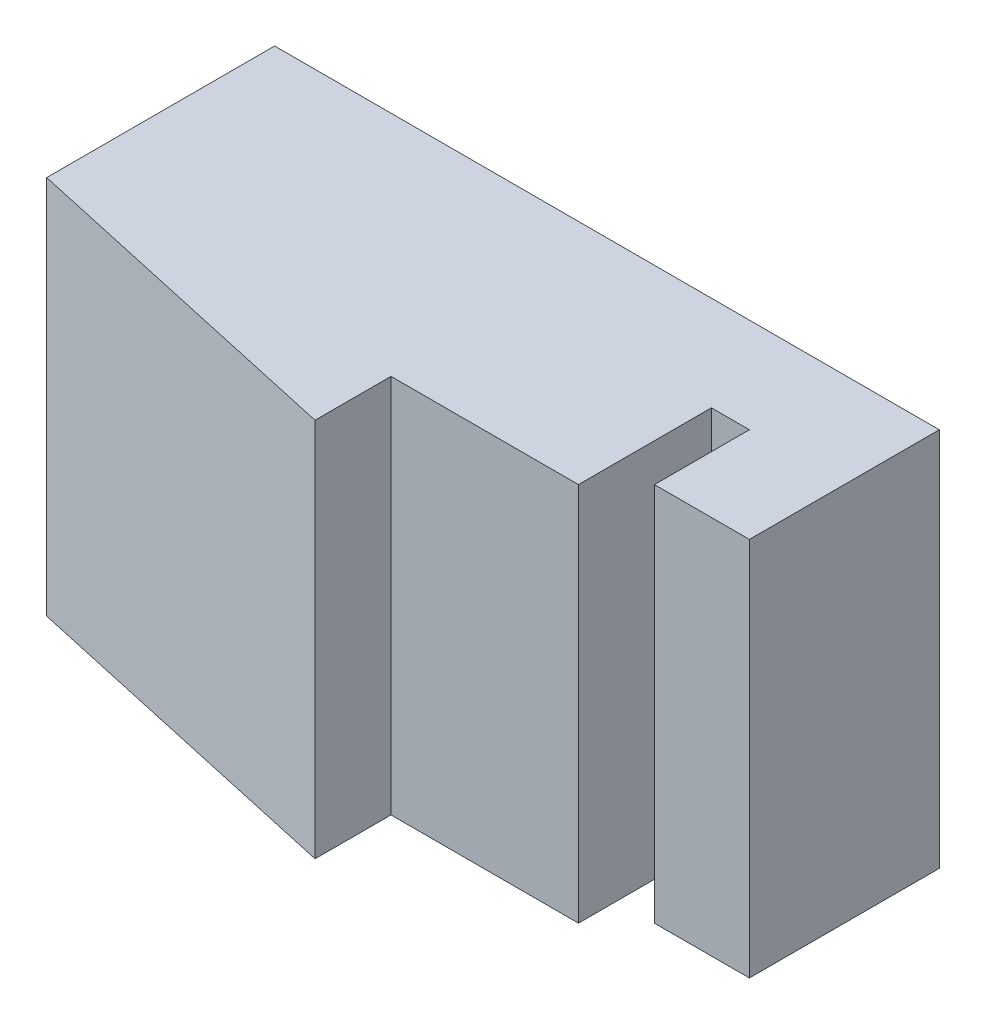
ISO-10303-21;
HEADER;
FILE_DESCRIPTION(('STEP AP214'),'2;1');
FILE_NAME('part.step','',(''),(''),'','','');
FILE_SCHEMA(('AUTOMOTIVE_DESIGN { 1 0 10303 214 1 1 1 1 }'));
ENDSEC;
DATA;
#1=APPLICATION_CONTEXT('core data for automotive mechanical design processes');
#2=APPLICATION_PROTOCOL_DEFINITION('international standard','automotive_design',2000,#1);
#3=PRODUCT_CONTEXT('',#1,'mechanical');
#4=PRODUCT('Part','Part','',(#3));
#5=PRODUCT_RELATED_PRODUCT_CATEGORY('part','',(#4));
#6=PRODUCT_DEFINITION_FORMATION('','',#4);
#7=PRODUCT_DEFINITION_CONTEXT('part definition',#1,'design');
#8=PRODUCT_DEFINITION('design','',#6,#7);
#9=PRODUCT_DEFINITION_SHAPE('','',#8);
#10=(LENGTH_UNIT() NAMED_UNIT(*) SI_UNIT(.MILLI.,.METRE.));
#11=(NAMED_UNIT(*) PLANE_ANGLE_UNIT() SI_UNIT($,.RADIAN.));
#12=(NAMED_UNIT(*) SI_UNIT($,.STERADIAN.) SOLID_ANGLE_UNIT());
#13=UNCERTAINTY_MEASURE_WITH_UNIT(LENGTH_MEASURE(1.E-05),#10,'distance_accuracy_value','');
#14=(GEOMETRIC_REPRESENTATION_CONTEXT(3) GLOBAL_UNCERTAINTY_ASSIGNED_CONTEXT((#13)) GLOBAL_UNIT_ASSIGNED_CONTEXT((#10,
#11,#12)) REPRESENTATION_CONTEXT('',''));
#15=CARTESIAN_POINT('',(0.,0.,0.));
#16=DIRECTION('',(0.,0.,1.));
#17=DIRECTION('',(1.,0.,0.));
#18=AXIS2_PLACEMENT_3D('',#15,#16,#17);
#19=CARTESIAN_POINT('',(-27.6289979058364,20.,0.));
#20=DIRECTION('',(1.,0.,0.));
#21=DIRECTION('',(0.,0.,-1.));
#22=AXIS2_PLACEMENT_3D('',#19,#20,#21);
#23=PLANE('',#22);
#24=DIRECTION('',(0.,0.,1.));
#25=VECTOR('',#24,1.);
#26=CARTESIAN_POINT('',(-27.6289979058364,0.,0.));
#27=LINE('',#26,#25);
#28=CARTESIAN_POINT('',(-27.6289979058364,0.,0.));
#29=VERTEX_POINT('',#28);
#30=CARTESIAN_POINT('',(-27.6289979058364,0.,12.));
#31=VERTEX_POINT('',#30);
#32=EDGE_CURVE('E141',#29,#31,#27,.T.);
#33=ORIENTED_EDGE('',*,*,#32,.T.);
#34=DIRECTION('',(0.,-1.,0.));
#35=VECTOR('',#34,1.);
#36=CARTESIAN_POINT('',(-27.6289979058364,20.,12.));
#37=LINE('',#36,#35);
#38=CARTESIAN_POINT('',(-27.6289979058364,20.,12.));
#39=VERTEX_POINT('',#38);
#40=EDGE_CURVE('E11',#39,#31,#37,.T.);
#41=ORIENTED_EDGE('',*,*,#40,.F.);
#42=DIRECTION('',(0.,0.,1.));
#43=VECTOR('',#42,1.);
#44=CARTESIAN_POINT('',(-27.6289979058364,20.,0.));
#45=LINE('',#44,#43);
#46=CARTESIAN_POINT('',(-27.6289979058364,20.,0.));
#47=VERTEX_POINT('',#46);
#48=EDGE_CURVE('E159',#47,#39,#45,.T.);
#49=ORIENTED_EDGE('',*,*,#48,.F.);
#50=DIRECTION('',(0.,-1.,0.));
#51=VECTOR('',#50,1.);
#52=CARTESIAN_POINT('',(-27.6289979058364,20.,0.));
#53=LINE('',#52,#51);
#54=EDGE_CURVE('E137',#47,#29,#53,.T.);
#55=ORIENTED_EDGE('',*,*,#54,.T.);
#56=EDGE_LOOP('',(#33,#41,#49,#55));
#57=FACE_BOUND('',#56,.T.);
#58=ADVANCED_FACE('F33',(#57),#23,.F.);
#59=CARTESIAN_POINT('',(-9.5,20.,16.));
#60=DIRECTION('',(0.215458778552168,0.,-0.976512936291582));
#61=DIRECTION('',(-0.976512936291582,0.,-0.215458778552168));
#62=AXIS2_PLACEMENT_3D('',#59,#60,#61);
#63=PLANE('',#62);
#64=DIRECTION('',(0.976512936291582,0.,0.215458778552168));
#65=VECTOR('',#64,1.);
#66=CARTESIAN_POINT('',(-9.5,0.,16.));
#67=LINE('',#66,#65);
#68=CARTESIAN_POINT('',(-9.5,0.,16.));
#69=VERTEX_POINT('',#68);
#70=EDGE_CURVE('E144',#31,#69,#67,.T.);
#71=ORIENTED_EDGE('',*,*,#70,.T.);
#72=DIRECTION('',(0.,-1.,0.));
#73=VECTOR('',#72,1.);
#74=CARTESIAN_POINT('',(-9.5,20.,16.));
#75=LINE('',#74,#73);
#76=CARTESIAN_POINT('',(-9.5,20.,16.));
#77=VERTEX_POINT('',#76);
#78=EDGE_CURVE('E41',#77,#69,#75,.T.);
#79=ORIENTED_EDGE('',*,*,#78,.F.);
#80=DIRECTION('',(0.976512936291582,0.,0.215458778552168));
#81=VECTOR('',#80,1.);
#82=CARTESIAN_POINT('',(-9.5,20.,16.));
#83=LINE('',#82,#81);
#84=EDGE_CURVE('E98',#39,#77,#83,.T.);
#85=ORIENTED_EDGE('',*,*,#84,.F.);
#86=ORIENTED_EDGE('',*,*,#40,.T.);
#87=EDGE_LOOP('',(#71,#79,#85,#86));
#88=FACE_BOUND('',#87,.T.);
#89=ADVANCED_FACE('F208',(#88),#63,.F.);
#90=CARTESIAN_POINT('',(-9.5,20.,12.));
#91=DIRECTION('',(-1.,0.,0.));
#92=DIRECTION('',(0.,0.,1.));
#93=AXIS2_PLACEMENT_3D('',#90,#91,#92);
#94=PLANE('',#93);
#95=DIRECTION('',(0.,0.,-1.));
#96=VECTOR('',#95,1.);
#97=CARTESIAN_POINT('',(-9.5,0.,12.));
#98=LINE('',#97,#96);
#99=CARTESIAN_POINT('',(-9.5,0.,12.));
#100=VERTEX_POINT('',#99);
#101=EDGE_CURVE('E146',#69,#100,#98,.T.);
#102=ORIENTED_EDGE('',*,*,#101,.T.);
#103=DIRECTION('',(0.,-1.,0.));
#104=VECTOR('',#103,1.);
#105=CARTESIAN_POINT('',(-9.5,20.,12.));
#106=LINE('',#105,#104);
#107=CARTESIAN_POINT('',(-9.5,20.,12.));
#108=VERTEX_POINT('',#107);
#109=EDGE_CURVE('E172',#108,#100,#106,.T.);
#110=ORIENTED_EDGE('',*,*,#109,.F.);
#111=DIRECTION('',(0.,0.,-1.));
#112=VECTOR('',#111,1.);
#113=CARTESIAN_POINT('',(-9.5,20.,12.));
#114=LINE('',#113,#112);
#115=EDGE_CURVE('E180',#77,#108,#114,.T.);
#116=ORIENTED_EDGE('',*,*,#115,.F.);
#117=ORIENTED_EDGE('',*,*,#78,.T.);
#118=EDGE_LOOP('',(#102,#110,#116,#117));
#119=FACE_BOUND('',#118,.T.);
#120=ADVANCED_FACE('F178',(#119),#94,.F.);
#121=CARTESIAN_POINT('',(0.371002094163587,20.,12.));
#122=DIRECTION('',(0.,0.,-1.));
#123=DIRECTION('',(-1.,0.,0.));
#124=AXIS2_PLACEMENT_3D('',#121,#122,#123);
#125=PLANE('',#124);
#126=DIRECTION('',(1.,0.,0.));
#127=VECTOR('',#126,1.);
#128=CARTESIAN_POINT('',(0.371002094163587,0.,12.));
#129=LINE('',#128,#127);
#130=CARTESIAN_POINT('',(0.371002094163587,0.,12.));
#131=VERTEX_POINT('',#130);
#132=EDGE_CURVE('E148',#100,#131,#129,.T.);
#133=ORIENTED_EDGE('',*,*,#132,.T.);
#134=DIRECTION('',(0.,-1.,0.));
#135=VECTOR('',#134,1.);
#136=CARTESIAN_POINT('',(0.371002094163587,20.,12.));
#137=LINE('',#136,#135);
#138=CARTESIAN_POINT('',(0.371002094163587,20.,12.));
#139=VERTEX_POINT('',#138);
#140=EDGE_CURVE('E169',#139,#131,#137,.T.);
#141=ORIENTED_EDGE('',*,*,#140,.F.);
#142=DIRECTION('',(1.,0.,0.));
#143=VECTOR('',#142,1.);
#144=CARTESIAN_POINT('',(0.371002094163587,20.,12.));
#145=LINE('',#144,#143);
#146=EDGE_CURVE('E198',#108,#139,#145,.T.);
#147=ORIENTED_EDGE('',*,*,#146,.F.);
#148=ORIENTED_EDGE('',*,*,#109,.T.);
#149=EDGE_LOOP('',(#133,#141,#147,#148));
#150=FACE_BOUND('',#149,.T.);
#151=ADVANCED_FACE('F189',(#150),#125,.F.);
#152=CARTESIAN_POINT('',(0.371002094163586,20.,4.99999999999994));
#153=DIRECTION('',(-1.,0.,0.));
#154=DIRECTION('',(0.,0.,1.));
#155=AXIS2_PLACEMENT_3D('',#152,#153,#154);
#156=PLANE('',#155);
#157=DIRECTION('',(0.,0.,-1.));
#158=VECTOR('',#157,1.);
#159=CARTESIAN_POINT('',(0.371002094163586,0.,4.99999999999994));
#160=LINE('',#159,#158);
#161=CARTESIAN_POINT('',(0.371002094163586,0.,4.99999999999994));
#162=VERTEX_POINT('',#161);
#163=EDGE_CURVE('E150',#131,#162,#160,.T.);
#164=ORIENTED_EDGE('',*,*,#163,.T.);
#165=DIRECTION('',(0.,-1.,0.));
#166=VECTOR('',#165,1.);
#167=CARTESIAN_POINT('',(0.371002094163586,20.,4.99999999999994));
#168=LINE('',#167,#166);
#169=CARTESIAN_POINT('',(0.371002094163586,20.,4.99999999999994));
#170=VERTEX_POINT('',#169);
#171=EDGE_CURVE('E166',#170,#162,#168,.T.);
#172=ORIENTED_EDGE('',*,*,#171,.F.);
#173=DIRECTION('',(0.,0.,-1.));
#174=VECTOR('',#173,1.);
#175=CARTESIAN_POINT('',(0.371002094163586,20.,4.99999999999994));
#176=LINE('',#175,#174);
#177=EDGE_CURVE('E195',#139,#170,#176,.T.);
#178=ORIENTED_EDGE('',*,*,#177,.F.);
#179=ORIENTED_EDGE('',*,*,#140,.T.);
#180=EDGE_LOOP('',(#164,#172,#178,#179));
#181=FACE_BOUND('',#180,.T.);
#182=ADVANCED_FACE('F193',(#181),#156,.F.);
#183=CARTESIAN_POINT('',(2.37100209416357,20.,4.99999999999994));
#184=DIRECTION('',(0.,0.,-1.));
#185=DIRECTION('',(-1.,0.,0.));
#186=AXIS2_PLACEMENT_3D('',#183,#184,#185);
#187=PLANE('',#186);
#188=DIRECTION('',(1.,0.,0.));
#189=VECTOR('',#188,1.);
#190=CARTESIAN_POINT('',(2.37100209416357,0.,4.99999999999994));
#191=LINE('',#190,#189);
#192=CARTESIAN_POINT('',(2.37100209416357,0.,4.99999999999994));
#193=VERTEX_POINT('',#192);
#194=EDGE_CURVE('E152',#162,#193,#191,.T.);
#195=ORIENTED_EDGE('',*,*,#194,.T.);
#196=DIRECTION('',(0.,-1.,0.));
#197=VECTOR('',#196,1.);
#198=CARTESIAN_POINT('',(2.37100209416357,20.,4.99999999999994));
#199=LINE('',#198,#197);
#200=CARTESIAN_POINT('',(2.37100209416357,20.,4.99999999999994));
#201=VERTEX_POINT('',#200);
#202=EDGE_CURVE('E163',#201,#193,#199,.T.);
#203=ORIENTED_EDGE('',*,*,#202,.F.);
#204=DIRECTION('',(1.,0.,0.));
#205=VECTOR('',#204,1.);
#206=CARTESIAN_POINT('',(2.37100209416357,20.,4.99999999999994));
#207=LINE('',#206,#205);
#208=EDGE_CURVE('E197',#170,#201,#207,.T.);
#209=ORIENTED_EDGE('',*,*,#208,.F.);
#210=ORIENTED_EDGE('',*,*,#171,.T.);
#211=EDGE_LOOP('',(#195,#203,#209,#210));
#212=FACE_BOUND('',#211,.T.);
#213=ADVANCED_FACE('F220',(#212),#187,.F.);
#214=CARTESIAN_POINT('',(2.37100209416357,20.,10.));
#215=DIRECTION('',(1.,0.,0.));
#216=DIRECTION('',(0.,0.,-1.));
#217=AXIS2_PLACEMENT_3D('',#214,#215,#216);
#218=PLANE('',#217);
#219=DIRECTION('',(0.,0.,1.));
#220=VECTOR('',#219,1.);
#221=CARTESIAN_POINT('',(2.37100209416357,0.,10.));
#222=LINE('',#221,#220);
#223=CARTESIAN_POINT('',(2.37100209416357,0.,10.));
#224=VERTEX_POINT('',#223);
#225=EDGE_CURVE('E154',#193,#224,#222,.T.);
#226=ORIENTED_EDGE('',*,*,#225,.T.);
#227=DIRECTION('',(0.,-1.,0.));
#228=VECTOR('',#227,1.);
#229=CARTESIAN_POINT('',(2.37100209416357,20.,10.));
#230=LINE('',#229,#228);
#231=CARTESIAN_POINT('',(2.37100209416357,20.,10.));
#232=VERTEX_POINT('',#231);
#233=EDGE_CURVE('E132',#232,#224,#230,.T.);
#234=ORIENTED_EDGE('',*,*,#233,.F.);
#235=DIRECTION('',(0.,0.,1.));
#236=VECTOR('',#235,1.);
#237=CARTESIAN_POINT('',(2.37100209416357,20.,10.));
#238=LINE('',#237,#236);
#239=EDGE_CURVE('E123',#201,#232,#238,.T.);
#240=ORIENTED_EDGE('',*,*,#239,.F.);
#241=ORIENTED_EDGE('',*,*,#202,.T.);
#242=EDGE_LOOP('',(#226,#234,#240,#241));
#243=FACE_BOUND('',#242,.T.);
#244=ADVANCED_FACE('F223',(#243),#218,.F.);
#245=CARTESIAN_POINT('',(7.37100209416357,20.,10.));
#246=DIRECTION('',(0.,0.,-1.));
#247=DIRECTION('',(-1.,0.,0.));
#248=AXIS2_PLACEMENT_3D('',#245,#246,#247);
#249=PLANE('',#248);
#250=DIRECTION('',(1.,0.,0.));
#251=VECTOR('',#250,1.);
#252=CARTESIAN_POINT('',(7.37100209416357,0.,10.));
#253=LINE('',#252,#251);
#254=CARTESIAN_POINT('',(7.37100209416357,0.,10.));
#255=VERTEX_POINT('',#254);
#256=EDGE_CURVE('E131',#224,#255,#253,.T.);
#257=ORIENTED_EDGE('',*,*,#256,.T.);
#258=DIRECTION('',(0.,-1.,0.));
#259=VECTOR('',#258,1.);
#260=CARTESIAN_POINT('',(7.37100209416357,20.,10.));
#261=LINE('',#260,#259);
#262=CARTESIAN_POINT('',(7.37100209416357,20.,10.));
#263=VERTEX_POINT('',#262);
#264=EDGE_CURVE('E128',#263,#255,#261,.T.);
#265=ORIENTED_EDGE('',*,*,#264,.F.);
#266=DIRECTION('',(1.,0.,0.));
#267=VECTOR('',#266,1.);
#268=CARTESIAN_POINT('',(7.37100209416357,20.,10.));
#269=LINE('',#268,#267);
#270=EDGE_CURVE('E117',#232,#263,#269,.T.);
#271=ORIENTED_EDGE('',*,*,#270,.F.);
#272=ORIENTED_EDGE('',*,*,#233,.T.);
#273=EDGE_LOOP('',(#257,#265,#271,#272));
#274=FACE_BOUND('',#273,.T.);
#275=ADVANCED_FACE('F129',(#274),#249,.F.);
#276=CARTESIAN_POINT('',(7.37100209416357,20.,0.));
#277=DIRECTION('',(-1.,0.,0.));
#278=DIRECTION('',(0.,0.,1.));
#279=AXIS2_PLACEMENT_3D('',#276,#277,#278);
#280=PLANE('',#279);
#281=DIRECTION('',(0.,0.,-1.));
#282=VECTOR('',#281,1.);
#283=CARTESIAN_POINT('',(7.37100209416357,0.,0.));
#284=LINE('',#283,#282);
#285=CARTESIAN_POINT('',(7.37100209416357,0.,0.));
#286=VERTEX_POINT('',#285);
#287=EDGE_CURVE('E84',#255,#286,#284,.T.);
#288=ORIENTED_EDGE('',*,*,#287,.T.);
#289=DIRECTION('',(0.,-1.,0.));
#290=VECTOR('',#289,1.);
#291=CARTESIAN_POINT('',(7.37100209416357,20.,0.));
#292=LINE('',#291,#290);
#293=CARTESIAN_POINT('',(7.37100209416357,20.,0.));
#294=VERTEX_POINT('',#293);
#295=EDGE_CURVE('E133',#294,#286,#292,.T.);
#296=ORIENTED_EDGE('',*,*,#295,.F.);
#297=DIRECTION('',(0.,0.,-1.));
#298=VECTOR('',#297,1.);
#299=CARTESIAN_POINT('',(7.37100209416357,20.,0.));
#300=LINE('',#299,#298);
#301=EDGE_CURVE('E121',#263,#294,#300,.T.);
#302=ORIENTED_EDGE('',*,*,#301,.F.);
#303=ORIENTED_EDGE('',*,*,#264,.T.);
#304=EDGE_LOOP('',(#288,#296,#302,#303));
#305=FACE_BOUND('',#304,.T.);
#306=ADVANCED_FACE('F135',(#305),#280,.F.);
#307=CARTESIAN_POINT('',(-27.6289979058364,20.,0.));
#308=DIRECTION('',(0.,0.,1.));
#309=DIRECTION('',(1.,0.,0.));
#310=AXIS2_PLACEMENT_3D('',#307,#308,#309);
#311=PLANE('',#310);
#312=DIRECTION('',(-1.,0.,0.));
#313=VECTOR('',#312,1.);
#314=CARTESIAN_POINT('',(-27.6289979058364,0.,0.));
#315=LINE('',#314,#313);
#316=EDGE_CURVE('E90',#286,#29,#315,.T.);
#317=ORIENTED_EDGE('',*,*,#316,.T.);
#318=ORIENTED_EDGE('',*,*,#54,.F.);
#319=DIRECTION('',(-1.,0.,0.));
#320=VECTOR('',#319,1.);
#321=CARTESIAN_POINT('',(-27.6289979058364,20.,0.));
#322=LINE('',#321,#320);
#323=EDGE_CURVE('E49',#294,#47,#322,.T.);
#324=ORIENTED_EDGE('',*,*,#323,.F.);
#325=ORIENTED_EDGE('',*,*,#295,.T.);
#326=EDGE_LOOP('',(#317,#318,#324,#325));
#327=FACE_BOUND('',#326,.T.);
#328=ADVANCED_FACE('F232',(#327),#311,.F.);
#329=CARTESIAN_POINT('',(0.,20.,0.));
#330=DIRECTION('',(0.,-1.,0.));
#331=DIRECTION('',(0.,0.,-1.));
#332=AXIS2_PLACEMENT_3D('',#329,#330,#331);
#333=PLANE('',#332);
#334=ORIENTED_EDGE('',*,*,#48,.T.);
#335=ORIENTED_EDGE('',*,*,#84,.T.);
#336=ORIENTED_EDGE('',*,*,#115,.T.);
#337=ORIENTED_EDGE('',*,*,#146,.T.);
#338=ORIENTED_EDGE('',*,*,#177,.T.);
#339=ORIENTED_EDGE('',*,*,#208,.T.);
#340=ORIENTED_EDGE('',*,*,#239,.T.);
#341=ORIENTED_EDGE('',*,*,#270,.T.);
#342=ORIENTED_EDGE('',*,*,#301,.T.);
#343=ORIENTED_EDGE('',*,*,#323,.T.);
#344=EDGE_LOOP('',(#334,#335,#336,#337,#338,#339,#340,#341,#342,#343));
#345=FACE_BOUND('',#344,.T.);
#346=ADVANCED_FACE('F119',(#345),#333,.F.);
#347=CARTESIAN_POINT('',(0.,0.,0.));
#348=DIRECTION('',(0.,-1.,0.));
#349=DIRECTION('',(0.,0.,-1.));
#350=AXIS2_PLACEMENT_3D('',#347,#348,#349);
#351=PLANE('',#350);
#352=ORIENTED_EDGE('',*,*,#32,.F.);
#353=ORIENTED_EDGE('',*,*,#316,.F.);
#354=ORIENTED_EDGE('',*,*,#287,.F.);
#355=ORIENTED_EDGE('',*,*,#256,.F.);
#356=ORIENTED_EDGE('',*,*,#225,.F.);
#357=ORIENTED_EDGE('',*,*,#194,.F.);
#358=ORIENTED_EDGE('',*,*,#163,.F.);
#359=ORIENTED_EDGE('',*,*,#132,.F.);
#360=ORIENTED_EDGE('',*,*,#101,.F.);
#361=ORIENTED_EDGE('',*,*,#70,.F.);
#362=EDGE_LOOP('',(#352,#353,#354,#355,#356,#357,#358,#359,#360,#361));
#363=FACE_BOUND('',#362,.T.);
#364=ADVANCED_FACE('F184',(#363),#351,.T.);
#365=CLOSED_SHELL('',(#58,#89,#120,#151,#182,#213,#244,#275,#306,#328,#346,#364));
#366=MANIFOLD_SOLID_BREP('B2',#365);
#367=ADVANCED_BREP_SHAPE_REPRESENTATION('',(#18,#366),#14);
#368=SHAPE_DEFINITION_REPRESENTATION(#9,#367);
ENDSEC;
END-ISO-10303-21;
